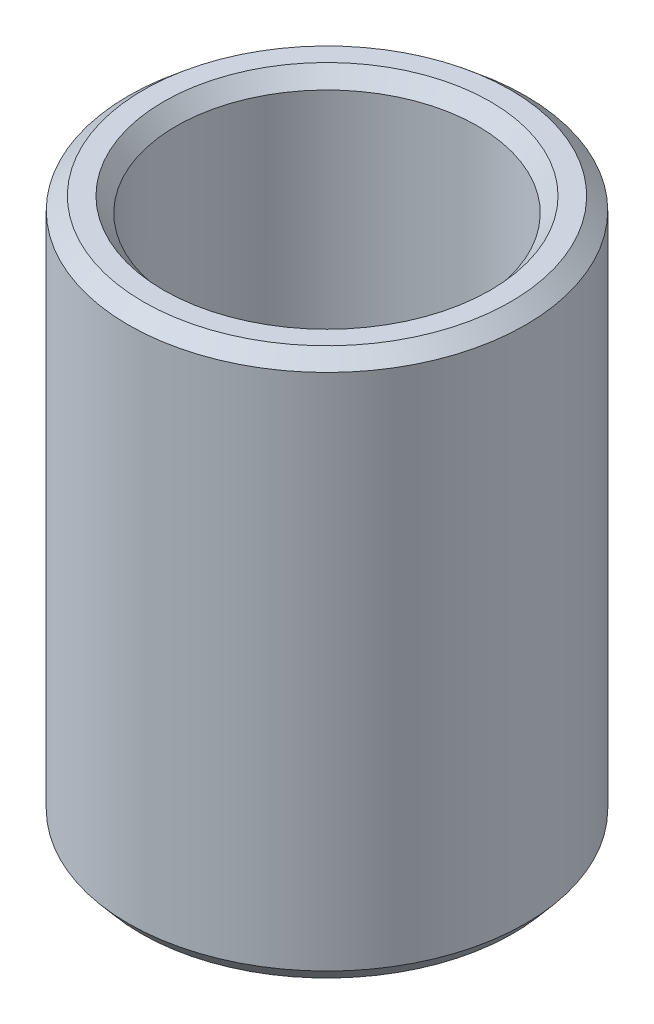
ISO-10303-21;
HEADER;
FILE_DESCRIPTION(('STEP AP214'),'2;1');
FILE_NAME('part.step','',(''),(''),'','','');
FILE_SCHEMA(('AUTOMOTIVE_DESIGN { 1 0 10303 214 1 1 1 1 }'));
ENDSEC;
DATA;
#1=APPLICATION_CONTEXT('core data for automotive mechanical design processes');
#2=APPLICATION_PROTOCOL_DEFINITION('international standard','automotive_design',2000,#1);
#3=PRODUCT_CONTEXT('',#1,'mechanical');
#4=PRODUCT('Part','Part','',(#3));
#5=PRODUCT_RELATED_PRODUCT_CATEGORY('part','',(#4));
#6=PRODUCT_DEFINITION_FORMATION('','',#4);
#7=PRODUCT_DEFINITION_CONTEXT('part definition',#1,'design');
#8=PRODUCT_DEFINITION('design','',#6,#7);
#9=PRODUCT_DEFINITION_SHAPE('','',#8);
#10=(LENGTH_UNIT() NAMED_UNIT(*) SI_UNIT(.MILLI.,.METRE.));
#11=(NAMED_UNIT(*) PLANE_ANGLE_UNIT() SI_UNIT($,.RADIAN.));
#12=(NAMED_UNIT(*) SI_UNIT($,.STERADIAN.) SOLID_ANGLE_UNIT());
#13=UNCERTAINTY_MEASURE_WITH_UNIT(LENGTH_MEASURE(1.E-05),#10,'distance_accuracy_value','');
#14=(GEOMETRIC_REPRESENTATION_CONTEXT(3) GLOBAL_UNCERTAINTY_ASSIGNED_CONTEXT((#13)) GLOBAL_UNIT_ASSIGNED_CONTEXT((#10,
#11,#12)) REPRESENTATION_CONTEXT('',''));
#15=CARTESIAN_POINT('',(0.,0.,0.));
#16=DIRECTION('',(0.,0.,1.));
#17=DIRECTION('',(1.,0.,0.));
#18=AXIS2_PLACEMENT_3D('',#15,#16,#17);
#19=CARTESIAN_POINT('',(0.,75.6233316740551,0.));
#20=DIRECTION('',(0.,-1.,0.));
#21=DIRECTION('',(0.,0.,-1.));
#22=AXIS2_PLACEMENT_3D('',#19,#20,#21);
#23=CYLINDRICAL_SURFACE('',#22,27.5);
#24=CARTESIAN_POINT('',(0.,2.06706198095742,0.));
#25=DIRECTION('',(0.,1.,0.));
#26=DIRECTION('',(0.,0.,1.));
#27=AXIS2_PLACEMENT_3D('',#24,#25,#26);
#28=CIRCLE('',#27,27.5);
#29=CARTESIAN_POINT('',(0.,2.06706198095741,-27.5));
#30=VERTEX_POINT('',#29);
#31=EDGE_CURVE('E10',#30,#30,#28,.T.);
#32=CARTESIAN_POINT('',(0.,73.8799828252635,0.));
#33=DIRECTION('',(0.,1.,0.));
#34=DIRECTION('',(0.,0.,1.));
#35=AXIS2_PLACEMENT_3D('',#32,#33,#34);
#36=CIRCLE('',#35,27.5);
#37=CARTESIAN_POINT('',(0.,73.8799828252635,-27.5));
#38=VERTEX_POINT('',#37);
#39=EDGE_CURVE('E50',#38,#38,#36,.F.);
#40=CARTESIAN_POINT('',(0.,2.06706198095741,-27.5));
#41=CARTESIAN_POINT('',(0.,2.81511323975226,-27.5));
#42=CARTESIAN_POINT('',(0.,3.56316449854712,-27.5));
#43=CARTESIAN_POINT('',(0.,5.05926701613683,-27.5));
#44=CARTESIAN_POINT('',(0.,5.80731827493169,-27.5));
#45=CARTESIAN_POINT('',(0.,7.3034207925214,-27.5));
#46=CARTESIAN_POINT('',(0.,8.05147205131625,-27.5));
#47=CARTESIAN_POINT('',(0.,9.54757456890596,-27.5));
#48=CARTESIAN_POINT('',(0.,10.2956258277008,-27.5));
#49=CARTESIAN_POINT('',(0.,11.7917283452905,-27.5));
#50=CARTESIAN_POINT('',(0.,12.5397796040854,-27.5));
#51=CARTESIAN_POINT('',(0.,14.0358821216751,-27.5));
#52=CARTESIAN_POINT('',(0.,14.7839333804699,-27.5));
#53=CARTESIAN_POINT('',(0.,16.2800358980597,-27.5));
#54=CARTESIAN_POINT('',(0.,17.0280871568545,-27.5));
#55=CARTESIAN_POINT('',(0.,18.5241896744442,-27.5));
#56=CARTESIAN_POINT('',(0.,19.2722409332391,-27.5));
#57=CARTESIAN_POINT('',(0.,20.7683434508288,-27.5));
#58=CARTESIAN_POINT('',(0.,21.5163947096236,-27.5));
#59=CARTESIAN_POINT('',(0.,23.0124972272134,-27.5));
#60=CARTESIAN_POINT('',(0.,23.7605484860082,-27.5));
#61=CARTESIAN_POINT('',(0.,25.2566510035979,-27.5));
#62=CARTESIAN_POINT('',(0.,26.0047022623928,-27.5));
#63=CARTESIAN_POINT('',(0.,27.5008047799825,-27.5));
#64=CARTESIAN_POINT('',(0.,28.2488560387773,-27.5));
#65=CARTESIAN_POINT('',(0.,29.7449585563671,-27.5));
#66=CARTESIAN_POINT('',(0.,30.4930098151619,-27.5));
#67=CARTESIAN_POINT('',(0.,31.9891123327516,-27.5));
#68=CARTESIAN_POINT('',(0.,32.7371635915465,-27.5));
#69=CARTESIAN_POINT('',(0.,34.2332661091362,-27.5));
#70=CARTESIAN_POINT('',(0.,34.981317367931,-27.5));
#71=CARTESIAN_POINT('',(0.,36.4774198855208,-27.5));
#72=CARTESIAN_POINT('',(0.,37.2254711443156,-27.5));
#73=CARTESIAN_POINT('',(0.,38.7215736619053,-27.5));
#74=CARTESIAN_POINT('',(0.,39.4696249207002,-27.5));
#75=CARTESIAN_POINT('',(0.,40.9657274382899,-27.5));
#76=CARTESIAN_POINT('',(0.,41.7137786970847,-27.5));
#77=CARTESIAN_POINT('',(0.,43.2098812146745,-27.5));
#78=CARTESIAN_POINT('',(0.,43.9579324734693,-27.5));
#79=CARTESIAN_POINT('',(0.,45.454034991059,-27.5));
#80=CARTESIAN_POINT('',(0.,46.2020862498539,-27.5));
#81=CARTESIAN_POINT('',(0.,47.6981887674436,-27.5));
#82=CARTESIAN_POINT('',(0.,48.4462400262384,-27.5));
#83=CARTESIAN_POINT('',(0.,49.9423425438281,-27.5));
#84=CARTESIAN_POINT('',(0.,50.690393802623,-27.5));
#85=CARTESIAN_POINT('',(0.,52.1864963202127,-27.5));
#86=CARTESIAN_POINT('',(0.,52.9345475790076,-27.5));
#87=CARTESIAN_POINT('',(0.,54.4306500965973,-27.5));
#88=CARTESIAN_POINT('',(0.,55.1787013553921,-27.5));
#89=CARTESIAN_POINT('',(0.,56.6748038729818,-27.5));
#90=CARTESIAN_POINT('',(0.,57.4228551317767,-27.5));
#91=CARTESIAN_POINT('',(0.,58.9189576493664,-27.5));
#92=CARTESIAN_POINT('',(0.,59.6670089081613,-27.5));
#93=CARTESIAN_POINT('',(0.,61.163111425751,-27.5));
#94=CARTESIAN_POINT('',(0.,61.9111626845458,-27.5));
#95=CARTESIAN_POINT('',(0.,63.4072652021355,-27.5));
#96=CARTESIAN_POINT('',(0.,64.1553164609304,-27.5));
#97=CARTESIAN_POINT('',(0.,65.6514189785201,-27.5));
#98=CARTESIAN_POINT('',(0.,66.399470237315,-27.5));
#99=CARTESIAN_POINT('',(0.,67.8955727549047,-27.5));
#100=CARTESIAN_POINT('',(0.,68.6436240136995,-27.5));
#101=CARTESIAN_POINT('',(0.,70.1397265312892,-27.5));
#102=CARTESIAN_POINT('',(0.,70.8877777900841,-27.5));
#103=CARTESIAN_POINT('',(0.,72.3838803076738,-27.5));
#104=CARTESIAN_POINT('',(0.,73.1319315664687,-27.5));
#105=CARTESIAN_POINT('',(0.,73.8799828252635,-27.5));
#106=B_SPLINE_CURVE_WITH_KNOTS('',3,(#40,#41,#42,#43,#44,#45,#46,#47,#48,#49,#50,#51,#52,#53,
#54,#55,#56,#57,#58,#59,#60,#61,#62,#63,#64,#65,#66,#67,#68,#69,#70,#71,#72,#73,#74,#75,#76,#77,
#78,#79,#80,#81,#82,#83,#84,#85,#86,#87,#88,#89,#90,#91,#92,#93,#94,#95,#96,#97,#98,#99,#100,
#101,#102,#103,#104,#105),.UNSPECIFIED.,.F.,.F.,(4,2,2,2,2,2,2,2,2,2,2,2,2,2,2,2,2,2,2,2,2,2,2,
2,2,2,2,2,2,2,2,2,4),(0.,2.24415377638457,4.48830755276913,6.7324613291537,8.97661510553827,
11.2207688819228,13.4649226583074,15.709076434692,17.9532302110765,20.1973839874611,
22.4415377638457,24.6856915402302,26.9298453166148,29.1739990929994,31.4181528693839,
33.6623066457685,35.9064604221531,38.1506141985376,40.3947679749222,42.6389217513067,
44.8830755276913,47.1272293040759,49.3713830804604,51.615536856845,53.8596906332296,
56.1038444096141,58.3479981859987,60.5921519623833,62.8363057387678,65.0804595151524,
67.324613291537,69.5687670679215,71.8129208443061),.UNSPECIFIED.);
#107=EDGE_CURVE('BSEAM39',#30,#38,#106,.T.);
#108=ORIENTED_EDGE('',*,*,#31,.T.);
#109=ORIENTED_EDGE('',*,*,#39,.T.);
#110=ORIENTED_EDGE('',*,*,#107,.T.);
#111=ORIENTED_EDGE('',*,*,#107,.F.);
#112=EDGE_LOOP('',(#108,#110,#109,#111));
#113=FACE_BOUND('',#112,.T.);
#114=ADVANCED_FACE('F39',(#113),#23,.T.);
#115=CARTESIAN_POINT('',(0.,75.6233316740551,0.));
#116=DIRECTION('',(0.,1.,0.));
#117=DIRECTION('',(0.,0.,1.));
#118=AXIS2_PLACEMENT_3D('',#115,#116,#117);
#119=PLANE('',#118);
#120=CARTESIAN_POINT('',(0.,75.6233316740551,0.));
#121=DIRECTION('',(0.,1.,0.));
#122=DIRECTION('',(0.,0.,1.));
#123=AXIS2_PLACEMENT_3D('',#120,#121,#122);
#124=CIRCLE('',#123,22.6316479323572);
#125=CARTESIAN_POINT('',(0.,75.6233316740551,22.6316479323572));
#126=VERTEX_POINT('',#125);
#127=EDGE_CURVE('E58',#126,#126,#124,.F.);
#128=ORIENTED_EDGE('',*,*,#127,.T.);
#129=EDGE_LOOP('',(#128));
#130=FACE_BOUND('',#129,.T.);
#131=CARTESIAN_POINT('',(0.,75.6233316740551,0.));
#132=DIRECTION('',(0.,1.,0.));
#133=DIRECTION('',(0.,0.,1.));
#134=AXIS2_PLACEMENT_3D('',#131,#132,#133);
#135=CIRCLE('',#134,25.4329380190427);
#136=CARTESIAN_POINT('',(0.,75.6233316740551,25.4329380190427));
#137=VERTEX_POINT('',#136);
#138=EDGE_CURVE('E61',#137,#137,#135,.T.);
#139=ORIENTED_EDGE('',*,*,#138,.T.);
#140=EDGE_LOOP('',(#139));
#141=FACE_BOUND('',#140,.T.);
#142=ADVANCED_FACE('F88',(#130,#141),#119,.T.);
#143=CARTESIAN_POINT('',(0.,0.,0.));
#144=DIRECTION('',(0.,1.,0.));
#145=DIRECTION('',(0.,0.,1.));
#146=AXIS2_PLACEMENT_3D('',#143,#144,#145);
#147=PLANE('',#146);
#148=CARTESIAN_POINT('',(0.,0.,0.));
#149=DIRECTION('',(0.,1.,0.));
#150=DIRECTION('',(0.,0.,1.));
#151=AXIS2_PLACEMENT_3D('',#148,#149,#150);
#152=CIRCLE('',#151,22.9553610645229);
#153=CARTESIAN_POINT('',(0.,0.,22.9553610645229));
#154=VERTEX_POINT('',#153);
#155=EDGE_CURVE('E51',#154,#154,#152,.T.);
#156=ORIENTED_EDGE('',*,*,#155,.T.);
#157=EDGE_LOOP('',(#156));
#158=FACE_BOUND('',#157,.T.);
#159=CARTESIAN_POINT('',(0.,0.,0.));
#160=DIRECTION('',(0.,1.,0.));
#161=DIRECTION('',(0.,0.,1.));
#162=AXIS2_PLACEMENT_3D('',#159,#160,#161);
#163=CIRCLE('',#162,25.7566511512083);
#164=CARTESIAN_POINT('',(0.,0.,25.7566511512083));
#165=VERTEX_POINT('',#164);
#166=EDGE_CURVE('E54',#165,#165,#163,.F.);
#167=ORIENTED_EDGE('',*,*,#166,.T.);
#168=EDGE_LOOP('',(#167));
#169=FACE_BOUND('',#168,.T.);
#170=ADVANCED_FACE('F83',(#158,#169),#147,.F.);
#171=CARTESIAN_POINT('',(0.,75.6233316740551,0.));
#172=DIRECTION('',(0.,-1.,0.));
#173=DIRECTION('',(0.,0.,-1.));
#174=AXIS2_PLACEMENT_3D('',#171,#172,#173);
#175=CYLINDRICAL_SURFACE('',#174,20.8882990835656);
#176=CARTESIAN_POINT('',(0.,73.5562696930976,0.));
#177=DIRECTION('',(0.,1.,0.));
#178=DIRECTION('',(0.,0.,1.));
#179=AXIS2_PLACEMENT_3D('',#176,#177,#178);
#180=CIRCLE('',#179,20.8882990835656);
#181=CARTESIAN_POINT('',(0.,73.5562696930976,-20.8882990835656));
#182=VERTEX_POINT('',#181);
#183=EDGE_CURVE('E67',#182,#182,#180,.T.);
#184=CARTESIAN_POINT('',(0.,1.74334884879156,0.));
#185=DIRECTION('',(0.,1.,0.));
#186=DIRECTION('',(0.,0.,1.));
#187=AXIS2_PLACEMENT_3D('',#184,#185,#186);
#188=CIRCLE('',#187,20.8882990835656);
#189=CARTESIAN_POINT('',(0.,1.74334884879154,-20.8882990835656));
#190=VERTEX_POINT('',#189);
#191=EDGE_CURVE('E69',#190,#190,#188,.F.);
#192=CARTESIAN_POINT('',(0.,73.5562696930976,-20.8882990835656));
#193=CARTESIAN_POINT('',(0.,72.8082184343028,-20.8882990835656));
#194=CARTESIAN_POINT('',(0.,72.0601671755079,-20.8882990835656));
#195=CARTESIAN_POINT('',(0.,70.5640646579182,-20.8882990835656));
#196=CARTESIAN_POINT('',(0.,69.8160133991234,-20.8882990835656));
#197=CARTESIAN_POINT('',(0.,68.3199108815336,-20.8882990835656));
#198=CARTESIAN_POINT('',(0.,67.5718596227388,-20.8882990835656));
#199=CARTESIAN_POINT('',(0.,66.0757571051491,-20.8882990835656));
#200=CARTESIAN_POINT('',(0.,65.3277058463542,-20.8882990835656));
#201=CARTESIAN_POINT('',(0.,63.8316033287645,-20.8882990835656));
#202=CARTESIAN_POINT('',(0.,63.0835520699697,-20.8882990835656));
#203=CARTESIAN_POINT('',(0.,61.58744955238,-20.8882990835656));
#204=CARTESIAN_POINT('',(0.,60.8393982935851,-20.8882990835656));
#205=CARTESIAN_POINT('',(0.,59.3432957759954,-20.8882990835656));
#206=CARTESIAN_POINT('',(0.,58.5952445172005,-20.8882990835656));
#207=CARTESIAN_POINT('',(0.,57.0991419996108,-20.8882990835656));
#208=CARTESIAN_POINT('',(0.,56.351090740816,-20.8882990835656));
#209=CARTESIAN_POINT('',(0.,54.8549882232263,-20.8882990835656));
#210=CARTESIAN_POINT('',(0.,54.1069369644314,-20.8882990835656));
#211=CARTESIAN_POINT('',(0.,52.6108344468417,-20.8882990835656));
#212=CARTESIAN_POINT('',(0.,51.8627831880468,-20.8882990835656));
#213=CARTESIAN_POINT('',(0.,50.3666806704571,-20.8882990835656));
#214=CARTESIAN_POINT('',(0.,49.6186294116623,-20.8882990835656));
#215=CARTESIAN_POINT('',(0.,48.1225268940726,-20.8882990835656));
#216=CARTESIAN_POINT('',(0.,47.3744756352777,-20.8882990835656));
#217=CARTESIAN_POINT('',(0.,45.878373117688,-20.8882990835656));
#218=CARTESIAN_POINT('',(0.,45.1303218588931,-20.8882990835656));
#219=CARTESIAN_POINT('',(0.,43.6342193413034,-20.8882990835656));
#220=CARTESIAN_POINT('',(0.,42.8861680825086,-20.8882990835656));
#221=CARTESIAN_POINT('',(0.,41.3900655649189,-20.8882990835656));
#222=CARTESIAN_POINT('',(0.,40.642014306124,-20.8882990835656));
#223=CARTESIAN_POINT('',(0.,39.1459117885343,-20.8882990835656));
#224=CARTESIAN_POINT('',(0.,38.3978605297394,-20.8882990835656));
#225=CARTESIAN_POINT('',(0.,36.9017580121497,-20.8882990835656));
#226=CARTESIAN_POINT('',(0.,36.1537067533549,-20.8882990835656));
#227=CARTESIAN_POINT('',(0.,34.6576042357652,-20.8882990835656));
#228=CARTESIAN_POINT('',(0.,33.9095529769703,-20.8882990835656));
#229=CARTESIAN_POINT('',(0.,32.4134504593806,-20.8882990835656));
#230=CARTESIAN_POINT('',(0.,31.6653992005857,-20.8882990835656));
#231=CARTESIAN_POINT('',(0.,30.169296682996,-20.8882990835656));
#232=CARTESIAN_POINT('',(0.,29.4212454242012,-20.8882990835656));
#233=CARTESIAN_POINT('',(0.,27.9251429066115,-20.8882990835656));
#234=CARTESIAN_POINT('',(0.,27.1770916478166,-20.8882990835656));
#235=CARTESIAN_POINT('',(0.,25.6809891302269,-20.8882990835656));
#236=CARTESIAN_POINT('',(0.,24.9329378714321,-20.8882990835656));
#237=CARTESIAN_POINT('',(0.,23.4368353538423,-20.8882990835656));
#238=CARTESIAN_POINT('',(0.,22.6887840950475,-20.8882990835656));
#239=CARTESIAN_POINT('',(0.,21.1926815774578,-20.8882990835656));
#240=CARTESIAN_POINT('',(0.,20.4446303186629,-20.8882990835656));
#241=CARTESIAN_POINT('',(0.,18.9485278010732,-20.8882990835656));
#242=CARTESIAN_POINT('',(0.,18.2004765422784,-20.8882990835656));
#243=CARTESIAN_POINT('',(0.,16.7043740246886,-20.8882990835656));
#244=CARTESIAN_POINT('',(0.,15.9563227658938,-20.8882990835656));
#245=CARTESIAN_POINT('',(0.,14.4602202483041,-20.8882990835656));
#246=CARTESIAN_POINT('',(0.,13.7121689895092,-20.8882990835656));
#247=CARTESIAN_POINT('',(0.,12.2160664719195,-20.8882990835656));
#248=CARTESIAN_POINT('',(0.,11.4680152131247,-20.8882990835656));
#249=CARTESIAN_POINT('',(0.,9.97191269553495,-20.8882990835656));
#250=CARTESIAN_POINT('',(0.,9.2238614367401,-20.8882990835656));
#251=CARTESIAN_POINT('',(0.,7.72775891915039,-20.8882990835656));
#252=CARTESIAN_POINT('',(0.,6.97970766035553,-20.8882990835656));
#253=CARTESIAN_POINT('',(0.,5.48360514276582,-20.8882990835656));
#254=CARTESIAN_POINT('',(0.,4.73555388397096,-20.8882990835656));
#255=CARTESIAN_POINT('',(0.,3.23945136638125,-20.8882990835656));
#256=CARTESIAN_POINT('',(0.,2.4914001075864,-20.8882990835656));
#257=CARTESIAN_POINT('',(0.,1.74334884879154,-20.8882990835656));
#258=B_SPLINE_CURVE_WITH_KNOTS('',3,(#192,#193,#194,#195,#196,#197,#198,#199,#200,#201,#202,
#203,#204,#205,#206,#207,#208,#209,#210,#211,#212,#213,#214,#215,#216,#217,#218,#219,#220,#221,
#222,#223,#224,#225,#226,#227,#228,#229,#230,#231,#232,#233,#234,#235,#236,#237,#238,#239,#240,
#241,#242,#243,#244,#245,#246,#247,#248,#249,#250,#251,#252,#253,#254,#255,#256,#257),
.UNSPECIFIED.,.F.,.F.,(4,2,2,2,2,2,2,2,2,2,2,2,2,2,2,2,2,2,2,2,2,2,2,2,2,2,2,2,2,2,2,2,4),(0.,
2.24415377638455,4.48830755276912,6.73246132915369,8.97661510553825,11.2207688819228,
13.4649226583074,15.709076434692,17.9532302110765,20.1973839874611,22.4415377638457,
24.6856915402302,26.9298453166148,29.1739990929993,31.4181528693839,33.6623066457685,
35.906460422153,38.1506141985376,40.3947679749222,42.6389217513067,44.8830755276913,
47.1272293040759,49.3713830804604,51.615536856845,53.8596906332296,56.1038444096141,
58.3479981859987,60.5921519623833,62.8363057387678,65.0804595151524,67.3246132915369,
69.5687670679215,71.8129208443061),.UNSPECIFIED.);
#259=EDGE_CURVE('BSEAM71',#182,#190,#258,.T.);
#260=ORIENTED_EDGE('',*,*,#183,.T.);
#261=ORIENTED_EDGE('',*,*,#191,.T.);
#262=ORIENTED_EDGE('',*,*,#259,.T.);
#263=ORIENTED_EDGE('',*,*,#259,.F.);
#264=EDGE_LOOP('',(#260,#262,#261,#263));
#265=FACE_BOUND('',#264,.T.);
#266=ADVANCED_FACE('F71',(#265),#175,.F.);
#267=CARTESIAN_POINT('',(0.,73.5562696930976,0.));
#268=DIRECTION('',(0.,1.,0.));
#269=DIRECTION('',(0.,0.,1.));
#270=AXIS2_PLACEMENT_3D('',#267,#268,#269);
#271=CONICAL_SURFACE('',#270,20.8882990835656,0.700646749597306);
#272=ORIENTED_EDGE('',*,*,#127,.F.);
#273=EDGE_LOOP('',(#272));
#274=FACE_BOUND('',#273,.T.);
#275=ORIENTED_EDGE('',*,*,#183,.F.);
#276=EDGE_LOOP('',(#275));
#277=FACE_BOUND('',#276,.T.);
#278=ADVANCED_FACE('F77',(#274,#277),#271,.F.);
#279=CARTESIAN_POINT('',(0.,0.,0.));
#280=DIRECTION('',(0.,-1.,0.));
#281=DIRECTION('',(0.,0.,-1.));
#282=AXIS2_PLACEMENT_3D('',#279,#280,#281);
#283=CONICAL_SURFACE('',#282,22.9553610645229,0.870149577197587);
#284=ORIENTED_EDGE('',*,*,#191,.F.);
#285=EDGE_LOOP('',(#284));
#286=FACE_BOUND('',#285,.T.);
#287=ORIENTED_EDGE('',*,*,#155,.F.);
#288=EDGE_LOOP('',(#287));
#289=FACE_BOUND('',#288,.T.);
#290=ADVANCED_FACE('F73',(#286,#289),#283,.F.);
#291=CARTESIAN_POINT('',(0.,2.06706198095742,0.));
#292=DIRECTION('',(0.,1.,0.));
#293=DIRECTION('',(0.,0.,1.));
#294=AXIS2_PLACEMENT_3D('',#291,#292,#293);
#295=CONICAL_SURFACE('',#294,27.5,0.700646749597314);
#296=ORIENTED_EDGE('',*,*,#166,.F.);
#297=EDGE_LOOP('',(#296));
#298=FACE_BOUND('',#297,.T.);
#299=ORIENTED_EDGE('',*,*,#31,.F.);
#300=EDGE_LOOP('',(#299));
#301=FACE_BOUND('',#300,.T.);
#302=ADVANCED_FACE('F76',(#298,#301),#295,.T.);
#303=CARTESIAN_POINT('',(0.,75.6233316740551,0.));
#304=DIRECTION('',(0.,-1.,0.));
#305=DIRECTION('',(0.,0.,-1.));
#306=AXIS2_PLACEMENT_3D('',#303,#304,#305);
#307=CONICAL_SURFACE('',#306,25.4329380190427,0.870149577197584);
#308=ORIENTED_EDGE('',*,*,#39,.F.);
#309=EDGE_LOOP('',(#308));
#310=FACE_BOUND('',#309,.T.);
#311=ORIENTED_EDGE('',*,*,#138,.F.);
#312=EDGE_LOOP('',(#311));
#313=FACE_BOUND('',#312,.T.);
#314=ADVANCED_FACE('F45',(#310,#313),#307,.T.);
#315=CLOSED_SHELL('',(#114,#142,#170,#266,#278,#290,#302,#314));
#316=MANIFOLD_SOLID_BREP('B2',#315);
#317=ADVANCED_BREP_SHAPE_REPRESENTATION('',(#18,#316),#14);
#318=SHAPE_DEFINITION_REPRESENTATION(#9,#317);
ENDSEC;
END-ISO-10303-21;
